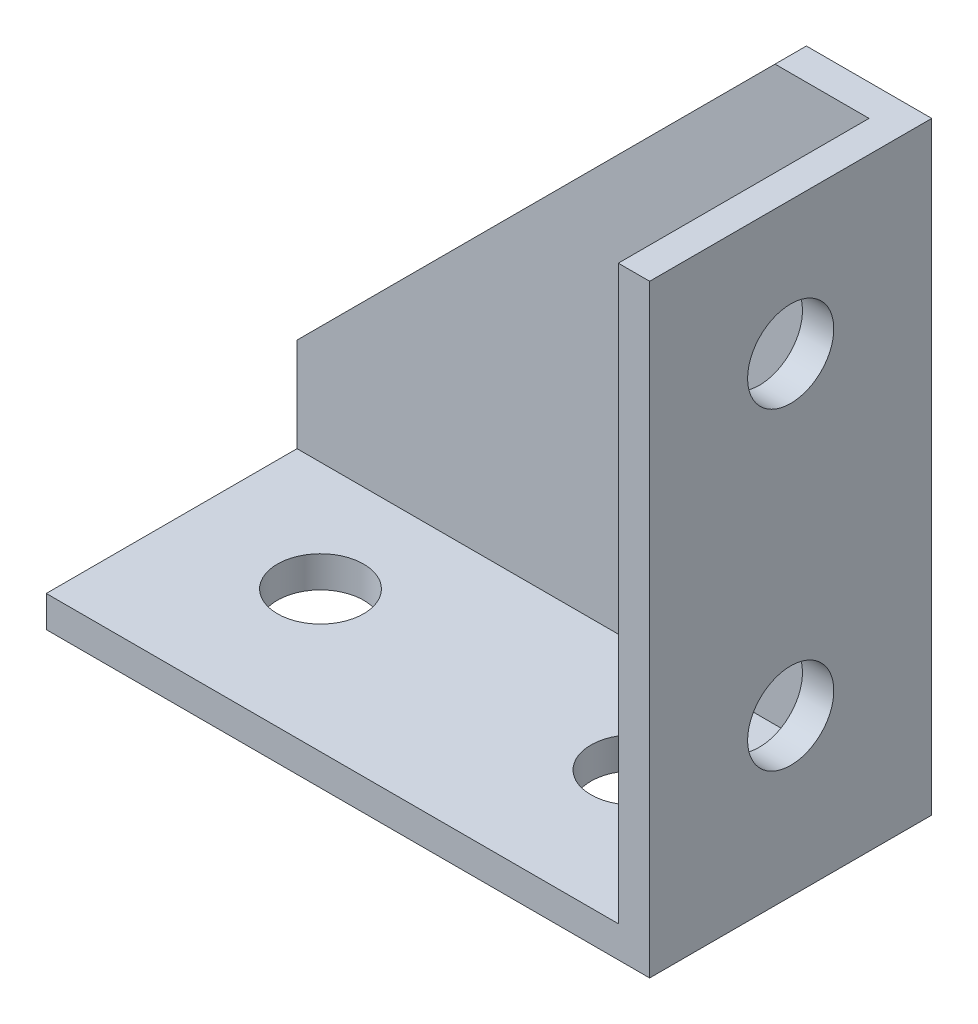
ISO-10303-21;
HEADER;
FILE_DESCRIPTION(('STEP AP214'),'2;1');
FILE_NAME('part.step','',(''),(''),'','','');
FILE_SCHEMA(('AUTOMOTIVE_DESIGN { 1 0 10303 214 1 1 1 1 }'));
ENDSEC;
DATA;
#1=APPLICATION_CONTEXT('core data for automotive mechanical design processes');
#2=APPLICATION_PROTOCOL_DEFINITION('international standard','automotive_design',2000,#1);
#3=PRODUCT_CONTEXT('',#1,'mechanical');
#4=PRODUCT('Part','Part','',(#3));
#5=PRODUCT_RELATED_PRODUCT_CATEGORY('part','',(#4));
#6=PRODUCT_DEFINITION_FORMATION('','',#4);
#7=PRODUCT_DEFINITION_CONTEXT('part definition',#1,'design');
#8=PRODUCT_DEFINITION('design','',#6,#7);
#9=PRODUCT_DEFINITION_SHAPE('','',#8);
#10=(LENGTH_UNIT() NAMED_UNIT(*) SI_UNIT(.MILLI.,.METRE.));
#11=(NAMED_UNIT(*) PLANE_ANGLE_UNIT() SI_UNIT($,.RADIAN.));
#12=(NAMED_UNIT(*) SI_UNIT($,.STERADIAN.) SOLID_ANGLE_UNIT());
#13=UNCERTAINTY_MEASURE_WITH_UNIT(LENGTH_MEASURE(1.E-05),#10,'distance_accuracy_value','');
#14=(GEOMETRIC_REPRESENTATION_CONTEXT(3) GLOBAL_UNCERTAINTY_ASSIGNED_CONTEXT((#13)) GLOBAL_UNIT_ASSIGNED_CONTEXT((#10,
#11,#12)) REPRESENTATION_CONTEXT('',''));
#15=CARTESIAN_POINT('',(0.,0.,0.));
#16=DIRECTION('',(0.,0.,1.));
#17=DIRECTION('',(1.,0.,0.));
#18=AXIS2_PLACEMENT_3D('',#15,#16,#17);
#19=CARTESIAN_POINT('',(0.,8.,18.));
#20=DIRECTION('',(0.707106781186547,-0.707106781186547,0.));
#21=DIRECTION('',(0.707106781186548,0.707106781186548,0.));
#22=AXIS2_PLACEMENT_3D('',#19,#20,#21);
#23=PLANE('',#22);
#24=DIRECTION('',(-0.707106781186547,-0.707106781186548,0.));
#25=VECTOR('',#24,1.);
#26=CARTESIAN_POINT('',(30.5,38.5,2.));
#27=LINE('',#26,#25);
#28=CARTESIAN_POINT('',(30.5,38.5,2.));
#29=VERTEX_POINT('',#28);
#30=CARTESIAN_POINT('',(0.,7.99999999999999,2.));
#31=VERTEX_POINT('',#30);
#32=EDGE_CURVE('E120',#29,#31,#27,.T.);
#33=ORIENTED_EDGE('',*,*,#32,.F.);
#34=DIRECTION('',(0.,0.,-1.));
#35=VECTOR('',#34,1.);
#36=CARTESIAN_POINT('',(30.5,38.5,18.));
#37=LINE('',#36,#35);
#38=CARTESIAN_POINT('',(30.5,38.5,0.));
#39=VERTEX_POINT('',#38);
#40=EDGE_CURVE('E155',#29,#39,#37,.T.);
#41=ORIENTED_EDGE('',*,*,#40,.T.);
#42=DIRECTION('',(-0.707106781186548,-0.707106781186548,0.));
#43=VECTOR('',#42,1.);
#44=CARTESIAN_POINT('',(0.,8.,0.));
#45=LINE('',#44,#43);
#46=CARTESIAN_POINT('',(0.,8.,0.));
#47=VERTEX_POINT('',#46);
#48=EDGE_CURVE('E148',#39,#47,#45,.T.);
#49=ORIENTED_EDGE('',*,*,#48,.T.);
#50=DIRECTION('',(0.,0.,-1.));
#51=VECTOR('',#50,1.);
#52=CARTESIAN_POINT('',(0.,8.,18.));
#53=LINE('',#52,#51);
#54=EDGE_CURVE('E153',#31,#47,#53,.T.);
#55=ORIENTED_EDGE('',*,*,#54,.F.);
#56=EDGE_LOOP('',(#33,#41,#49,#55));
#57=FACE_BOUND('',#56,.T.);
#58=ADVANCED_FACE('F35',(#57),#23,.F.);
#59=CARTESIAN_POINT('',(0.,0.,18.));
#60=DIRECTION('',(0.,1.,0.));
#61=DIRECTION('',(0.,0.,1.));
#62=AXIS2_PLACEMENT_3D('',#59,#60,#61);
#63=PLANE('',#62);
#64=CARTESIAN_POINT('',(8.5,0.,9.));
#65=DIRECTION('',(0.,1.,0.));
#66=DIRECTION('',(0.,0.,1.));
#67=AXIS2_PLACEMENT_3D('',#64,#65,#66);
#68=CIRCLE('',#67,2.74999999999999);
#69=CARTESIAN_POINT('',(8.5,0.,11.75));
#70=VERTEX_POINT('',#69);
#71=EDGE_CURVE('E247',#70,#70,#68,.T.);
#72=ORIENTED_EDGE('',*,*,#71,.T.);
#73=EDGE_LOOP('',(#72));
#74=FACE_BOUND('',#73,.T.);
#75=CARTESIAN_POINT('',(28.5,0.,9.));
#76=DIRECTION('',(0.,1.,0.));
#77=DIRECTION('',(0.,0.,1.));
#78=AXIS2_PLACEMENT_3D('',#75,#76,#77);
#79=CIRCLE('',#78,2.74999999999999);
#80=CARTESIAN_POINT('',(28.5,0.,11.75));
#81=VERTEX_POINT('',#80);
#82=EDGE_CURVE('E174',#81,#81,#79,.T.);
#83=ORIENTED_EDGE('',*,*,#82,.T.);
#84=EDGE_LOOP('',(#83));
#85=FACE_BOUND('',#84,.T.);
#86=DIRECTION('',(1.,0.,0.));
#87=VECTOR('',#86,1.);
#88=CARTESIAN_POINT('',(0.,0.,0.));
#89=LINE('',#88,#87);
#90=CARTESIAN_POINT('',(0.,0.,0.));
#91=VERTEX_POINT('',#90);
#92=CARTESIAN_POINT('',(38.5,0.,0.));
#93=VERTEX_POINT('',#92);
#94=EDGE_CURVE('E140',#91,#93,#89,.T.);
#95=ORIENTED_EDGE('',*,*,#94,.T.);
#96=DIRECTION('',(0.,0.,-1.));
#97=VECTOR('',#96,1.);
#98=CARTESIAN_POINT('',(38.5,0.,18.));
#99=LINE('',#98,#97);
#100=CARTESIAN_POINT('',(38.5,0.,18.));
#101=VERTEX_POINT('',#100);
#102=EDGE_CURVE('E11',#101,#93,#99,.T.);
#103=ORIENTED_EDGE('',*,*,#102,.F.);
#104=DIRECTION('',(1.,0.,0.));
#105=VECTOR('',#104,1.);
#106=CARTESIAN_POINT('',(0.,0.,18.));
#107=LINE('',#106,#105);
#108=CARTESIAN_POINT('',(0.,0.,18.));
#109=VERTEX_POINT('',#108);
#110=EDGE_CURVE('E132',#109,#101,#107,.T.);
#111=ORIENTED_EDGE('',*,*,#110,.F.);
#112=DIRECTION('',(0.,0.,-1.));
#113=VECTOR('',#112,1.);
#114=CARTESIAN_POINT('',(0.,0.,18.));
#115=LINE('',#114,#113);
#116=EDGE_CURVE('E139',#109,#91,#115,.T.);
#117=ORIENTED_EDGE('',*,*,#116,.T.);
#118=EDGE_LOOP('',(#95,#103,#111,#117));
#119=FACE_BOUND('',#118,.T.);
#120=ADVANCED_FACE('F37',(#74,#85,#119),#63,.F.);
#121=CARTESIAN_POINT('',(38.5,0.,18.));
#122=DIRECTION('',(-1.,0.,0.));
#123=DIRECTION('',(0.,0.,1.));
#124=AXIS2_PLACEMENT_3D('',#121,#122,#123);
#125=PLANE('',#124);
#126=CARTESIAN_POINT('',(38.5,10.,9.));
#127=DIRECTION('',(-1.,0.,0.));
#128=DIRECTION('',(0.,0.,1.));
#129=AXIS2_PLACEMENT_3D('',#126,#127,#128);
#130=CIRCLE('',#129,2.74999999999999);
#131=CARTESIAN_POINT('',(38.5,10.,11.75));
#132=VERTEX_POINT('',#131);
#133=EDGE_CURVE('E231',#132,#132,#130,.T.);
#134=ORIENTED_EDGE('',*,*,#133,.T.);
#135=EDGE_LOOP('',(#134));
#136=FACE_BOUND('',#135,.T.);
#137=CARTESIAN_POINT('',(38.5,30.,9.));
#138=DIRECTION('',(-1.,0.,0.));
#139=DIRECTION('',(0.,0.,1.));
#140=AXIS2_PLACEMENT_3D('',#137,#138,#139);
#141=CIRCLE('',#140,2.74999999999999);
#142=CARTESIAN_POINT('',(38.5,30.,11.75));
#143=VERTEX_POINT('',#142);
#144=EDGE_CURVE('E241',#143,#143,#141,.T.);
#145=ORIENTED_EDGE('',*,*,#144,.T.);
#146=EDGE_LOOP('',(#145));
#147=FACE_BOUND('',#146,.T.);
#148=DIRECTION('',(0.,1.,0.));
#149=VECTOR('',#148,1.);
#150=CARTESIAN_POINT('',(38.5,0.,0.));
#151=LINE('',#150,#149);
#152=CARTESIAN_POINT('',(38.5,38.5,0.));
#153=VERTEX_POINT('',#152);
#154=EDGE_CURVE('E143',#93,#153,#151,.T.);
#155=ORIENTED_EDGE('',*,*,#154,.T.);
#156=DIRECTION('',(0.,0.,-1.));
#157=VECTOR('',#156,1.);
#158=CARTESIAN_POINT('',(38.5,38.5,18.));
#159=LINE('',#158,#157);
#160=CARTESIAN_POINT('',(38.5,38.5,18.));
#161=VERTEX_POINT('',#160);
#162=EDGE_CURVE('E43',#161,#153,#159,.T.);
#163=ORIENTED_EDGE('',*,*,#162,.F.);
#164=DIRECTION('',(0.,1.,0.));
#165=VECTOR('',#164,1.);
#166=CARTESIAN_POINT('',(38.5,0.,18.));
#167=LINE('',#166,#165);
#168=EDGE_CURVE('E86',#101,#161,#167,.T.);
#169=ORIENTED_EDGE('',*,*,#168,.F.);
#170=ORIENTED_EDGE('',*,*,#102,.T.);
#171=EDGE_LOOP('',(#155,#163,#169,#170));
#172=FACE_BOUND('',#171,.T.);
#173=ADVANCED_FACE('F182',(#136,#147,#172),#125,.F.);
#174=CARTESIAN_POINT('',(30.5,38.5,18.));
#175=DIRECTION('',(0.,-1.,0.));
#176=DIRECTION('',(0.,0.,-1.));
#177=AXIS2_PLACEMENT_3D('',#174,#175,#176);
#178=PLANE('',#177);
#179=DIRECTION('',(-1.,0.,0.));
#180=VECTOR('',#179,1.);
#181=CARTESIAN_POINT('',(36.5,38.5,2.));
#182=LINE('',#181,#180);
#183=CARTESIAN_POINT('',(36.5,38.5,2.));
#184=VERTEX_POINT('',#183);
#185=EDGE_CURVE('E128',#184,#29,#182,.T.);
#186=ORIENTED_EDGE('',*,*,#185,.F.);
#187=DIRECTION('',(0.,0.,1.));
#188=VECTOR('',#187,1.);
#189=CARTESIAN_POINT('',(36.5,38.5,2.));
#190=LINE('',#189,#188);
#191=CARTESIAN_POINT('',(36.5,38.5,18.));
#192=VERTEX_POINT('',#191);
#193=EDGE_CURVE('E126',#184,#192,#190,.T.);
#194=ORIENTED_EDGE('',*,*,#193,.T.);
#195=DIRECTION('',(-1.,0.,0.));
#196=VECTOR('',#195,1.);
#197=CARTESIAN_POINT('',(30.5,38.5,18.));
#198=LINE('',#197,#196);
#199=EDGE_CURVE('E135',#161,#192,#198,.T.);
#200=ORIENTED_EDGE('',*,*,#199,.F.);
#201=ORIENTED_EDGE('',*,*,#162,.T.);
#202=DIRECTION('',(-1.,0.,0.));
#203=VECTOR('',#202,1.);
#204=CARTESIAN_POINT('',(30.5,38.5,0.));
#205=LINE('',#204,#203);
#206=EDGE_CURVE('E145',#153,#39,#205,.T.);
#207=ORIENTED_EDGE('',*,*,#206,.T.);
#208=ORIENTED_EDGE('',*,*,#40,.F.);
#209=EDGE_LOOP('',(#186,#194,#200,#201,#207,#208));
#210=FACE_BOUND('',#209,.T.);
#211=ADVANCED_FACE('F161',(#210),#178,.F.);
#212=CARTESIAN_POINT('',(0.,0.,18.));
#213=DIRECTION('',(1.,0.,0.));
#214=DIRECTION('',(0.,0.,-1.));
#215=AXIS2_PLACEMENT_3D('',#212,#213,#214);
#216=PLANE('',#215);
#217=DIRECTION('',(0.,-1.,0.));
#218=VECTOR('',#217,1.);
#219=CARTESIAN_POINT('',(0.,0.,18.));
#220=LINE('',#219,#218);
#221=CARTESIAN_POINT('',(0.,2.,18.));
#222=VERTEX_POINT('',#221);
#223=EDGE_CURVE('E58',#222,#109,#220,.T.);
#224=ORIENTED_EDGE('',*,*,#223,.F.);
#225=DIRECTION('',(0.,0.,1.));
#226=VECTOR('',#225,1.);
#227=CARTESIAN_POINT('',(0.,2.,2.));
#228=LINE('',#227,#226);
#229=CARTESIAN_POINT('',(0.,2.,2.));
#230=VERTEX_POINT('',#229);
#231=EDGE_CURVE('E50',#230,#222,#228,.T.);
#232=ORIENTED_EDGE('',*,*,#231,.F.);
#233=DIRECTION('',(0.,-1.,0.));
#234=VECTOR('',#233,1.);
#235=CARTESIAN_POINT('',(0.,7.99999999999999,2.));
#236=LINE('',#235,#234);
#237=EDGE_CURVE('E115',#31,#230,#236,.T.);
#238=ORIENTED_EDGE('',*,*,#237,.F.);
#239=ORIENTED_EDGE('',*,*,#54,.T.);
#240=DIRECTION('',(0.,-1.,0.));
#241=VECTOR('',#240,1.);
#242=CARTESIAN_POINT('',(0.,0.,0.));
#243=LINE('',#242,#241);
#244=EDGE_CURVE('E81',#47,#91,#243,.T.);
#245=ORIENTED_EDGE('',*,*,#244,.T.);
#246=ORIENTED_EDGE('',*,*,#116,.F.);
#247=EDGE_LOOP('',(#224,#232,#238,#239,#245,#246));
#248=FACE_BOUND('',#247,.T.);
#249=ADVANCED_FACE('F124',(#248),#216,.F.);
#250=CARTESIAN_POINT('',(0.,0.,18.));
#251=DIRECTION('',(0.,0.,1.));
#252=DIRECTION('',(1.,0.,0.));
#253=AXIS2_PLACEMENT_3D('',#250,#251,#252);
#254=PLANE('',#253);
#255=DIRECTION('',(0.,1.,0.));
#256=VECTOR('',#255,1.);
#257=CARTESIAN_POINT('',(36.5,2.,18.));
#258=LINE('',#257,#256);
#259=CARTESIAN_POINT('',(36.5,2.,18.));
#260=VERTEX_POINT('',#259);
#261=EDGE_CURVE('E122',#260,#192,#258,.T.);
#262=ORIENTED_EDGE('',*,*,#261,.F.);
#263=DIRECTION('',(1.,0.,0.));
#264=VECTOR('',#263,1.);
#265=CARTESIAN_POINT('',(0.,2.,18.));
#266=LINE('',#265,#264);
#267=EDGE_CURVE('E172',#222,#260,#266,.T.);
#268=ORIENTED_EDGE('',*,*,#267,.F.);
#269=ORIENTED_EDGE('',*,*,#223,.T.);
#270=ORIENTED_EDGE('',*,*,#110,.T.);
#271=ORIENTED_EDGE('',*,*,#168,.T.);
#272=ORIENTED_EDGE('',*,*,#199,.T.);
#273=EDGE_LOOP('',(#262,#268,#269,#270,#271,#272));
#274=FACE_BOUND('',#273,.T.);
#275=ADVANCED_FACE('F178',(#274),#254,.T.);
#276=CARTESIAN_POINT('',(0.,0.,0.));
#277=DIRECTION('',(0.,0.,1.));
#278=DIRECTION('',(1.,0.,0.));
#279=AXIS2_PLACEMENT_3D('',#276,#277,#278);
#280=PLANE('',#279);
#281=ORIENTED_EDGE('',*,*,#94,.F.);
#282=ORIENTED_EDGE('',*,*,#244,.F.);
#283=ORIENTED_EDGE('',*,*,#48,.F.);
#284=ORIENTED_EDGE('',*,*,#206,.F.);
#285=ORIENTED_EDGE('',*,*,#154,.F.);
#286=EDGE_LOOP('',(#281,#282,#283,#284,#285));
#287=FACE_BOUND('',#286,.T.);
#288=ADVANCED_FACE('F167',(#287),#280,.F.);
#289=CARTESIAN_POINT('',(36.5,2.,2.));
#290=DIRECTION('',(1.,0.,0.));
#291=DIRECTION('',(0.,0.,-1.));
#292=AXIS2_PLACEMENT_3D('',#289,#290,#291);
#293=PLANE('',#292);
#294=CARTESIAN_POINT('',(36.5,10.,9.));
#295=DIRECTION('',(-1.,0.,0.));
#296=DIRECTION('',(0.,0.,1.));
#297=AXIS2_PLACEMENT_3D('',#294,#295,#296);
#298=CIRCLE('',#297,2.74999999999999);
#299=CARTESIAN_POINT('',(36.5,10.,11.75));
#300=VERTEX_POINT('',#299);
#301=EDGE_CURVE('E234',#300,#300,#298,.T.);
#302=ORIENTED_EDGE('',*,*,#301,.F.);
#303=EDGE_LOOP('',(#302));
#304=FACE_BOUND('',#303,.T.);
#305=CARTESIAN_POINT('',(36.5,30.,9.));
#306=DIRECTION('',(-1.,0.,0.));
#307=DIRECTION('',(0.,0.,1.));
#308=AXIS2_PLACEMENT_3D('',#305,#306,#307);
#309=CIRCLE('',#308,2.74999999999999);
#310=CARTESIAN_POINT('',(36.5,30.,11.75));
#311=VERTEX_POINT('',#310);
#312=EDGE_CURVE('E236',#311,#311,#309,.T.);
#313=ORIENTED_EDGE('',*,*,#312,.F.);
#314=EDGE_LOOP('',(#313));
#315=FACE_BOUND('',#314,.T.);
#316=ORIENTED_EDGE('',*,*,#261,.T.);
#317=ORIENTED_EDGE('',*,*,#193,.F.);
#318=DIRECTION('',(0.,1.,0.));
#319=VECTOR('',#318,1.);
#320=CARTESIAN_POINT('',(36.5,2.,2.));
#321=LINE('',#320,#319);
#322=CARTESIAN_POINT('',(36.5,2.,2.));
#323=VERTEX_POINT('',#322);
#324=EDGE_CURVE('E114',#323,#184,#321,.T.);
#325=ORIENTED_EDGE('',*,*,#324,.F.);
#326=DIRECTION('',(0.,0.,1.));
#327=VECTOR('',#326,1.);
#328=CARTESIAN_POINT('',(36.5,2.,2.));
#329=LINE('',#328,#327);
#330=EDGE_CURVE('E110',#323,#260,#329,.T.);
#331=ORIENTED_EDGE('',*,*,#330,.T.);
#332=EDGE_LOOP('',(#316,#317,#325,#331));
#333=FACE_BOUND('',#332,.T.);
#334=ADVANCED_FACE('F177',(#304,#315,#333),#293,.F.);
#335=CARTESIAN_POINT('',(0.,2.,2.));
#336=DIRECTION('',(0.,-1.,0.));
#337=DIRECTION('',(0.,0.,-1.));
#338=AXIS2_PLACEMENT_3D('',#335,#336,#337);
#339=PLANE('',#338);
#340=CARTESIAN_POINT('',(8.5,2.,9.));
#341=DIRECTION('',(0.,1.,0.));
#342=DIRECTION('',(0.,0.,1.));
#343=AXIS2_PLACEMENT_3D('',#340,#341,#342);
#344=CIRCLE('',#343,2.74999999999999);
#345=CARTESIAN_POINT('',(8.5,2.,11.75));
#346=VERTEX_POINT('',#345);
#347=EDGE_CURVE('E244',#346,#346,#344,.T.);
#348=ORIENTED_EDGE('',*,*,#347,.F.);
#349=EDGE_LOOP('',(#348));
#350=FACE_BOUND('',#349,.T.);
#351=CARTESIAN_POINT('',(28.5,2.,9.));
#352=DIRECTION('',(0.,1.,0.));
#353=DIRECTION('',(0.,0.,1.));
#354=AXIS2_PLACEMENT_3D('',#351,#352,#353);
#355=CIRCLE('',#354,2.74999999999999);
#356=CARTESIAN_POINT('',(28.5,2.,11.75));
#357=VERTEX_POINT('',#356);
#358=EDGE_CURVE('E250',#357,#357,#355,.T.);
#359=ORIENTED_EDGE('',*,*,#358,.F.);
#360=EDGE_LOOP('',(#359));
#361=FACE_BOUND('',#360,.T.);
#362=ORIENTED_EDGE('',*,*,#267,.T.);
#363=ORIENTED_EDGE('',*,*,#330,.F.);
#364=DIRECTION('',(1.,0.,0.));
#365=VECTOR('',#364,1.);
#366=CARTESIAN_POINT('',(0.,2.,2.));
#367=LINE('',#366,#365);
#368=EDGE_CURVE('E107',#230,#323,#367,.T.);
#369=ORIENTED_EDGE('',*,*,#368,.F.);
#370=ORIENTED_EDGE('',*,*,#231,.T.);
#371=EDGE_LOOP('',(#362,#363,#369,#370));
#372=FACE_BOUND('',#371,.T.);
#373=ADVANCED_FACE('F109',(#350,#361,#372),#339,.F.);
#374=CARTESIAN_POINT('',(0.,0.,2.));
#375=DIRECTION('',(0.,0.,1.));
#376=DIRECTION('',(1.,0.,0.));
#377=AXIS2_PLACEMENT_3D('',#374,#375,#376);
#378=PLANE('',#377);
#379=ORIENTED_EDGE('',*,*,#237,.T.);
#380=ORIENTED_EDGE('',*,*,#368,.T.);
#381=ORIENTED_EDGE('',*,*,#324,.T.);
#382=ORIENTED_EDGE('',*,*,#185,.T.);
#383=ORIENTED_EDGE('',*,*,#32,.T.);
#384=EDGE_LOOP('',(#379,#380,#381,#382,#383));
#385=FACE_BOUND('',#384,.T.);
#386=ADVANCED_FACE('F118',(#385),#378,.T.);
#387=CARTESIAN_POINT('',(28.5,2.,9.));
#388=DIRECTION('',(0.,1.,0.));
#389=DIRECTION('',(0.,0.,1.));
#390=AXIS2_PLACEMENT_3D('',#387,#388,#389);
#391=CYLINDRICAL_SURFACE('',#390,2.74999999999999);
#392=ORIENTED_EDGE('',*,*,#82,.F.);
#393=EDGE_LOOP('',(#392));
#394=FACE_BOUND('',#393,.T.);
#395=ORIENTED_EDGE('',*,*,#358,.T.);
#396=EDGE_LOOP('',(#395));
#397=FACE_BOUND('',#396,.T.);
#398=ADVANCED_FACE('F212',(#394,#397),#391,.F.);
#399=CARTESIAN_POINT('',(8.5,2.,9.));
#400=DIRECTION('',(0.,1.,0.));
#401=DIRECTION('',(0.,0.,1.));
#402=AXIS2_PLACEMENT_3D('',#399,#400,#401);
#403=CYLINDRICAL_SURFACE('',#402,2.74999999999999);
#404=ORIENTED_EDGE('',*,*,#71,.F.);
#405=EDGE_LOOP('',(#404));
#406=FACE_BOUND('',#405,.T.);
#407=ORIENTED_EDGE('',*,*,#347,.T.);
#408=EDGE_LOOP('',(#407));
#409=FACE_BOUND('',#408,.T.);
#410=ADVANCED_FACE('F215',(#406,#409),#403,.F.);
#411=CARTESIAN_POINT('',(36.5,30.,9.));
#412=DIRECTION('',(-1.,0.,0.));
#413=DIRECTION('',(0.,0.,1.));
#414=AXIS2_PLACEMENT_3D('',#411,#412,#413);
#415=CYLINDRICAL_SURFACE('',#414,2.74999999999999);
#416=ORIENTED_EDGE('',*,*,#144,.F.);
#417=EDGE_LOOP('',(#416));
#418=FACE_BOUND('',#417,.T.);
#419=ORIENTED_EDGE('',*,*,#312,.T.);
#420=EDGE_LOOP('',(#419));
#421=FACE_BOUND('',#420,.T.);
#422=ADVANCED_FACE('F219',(#418,#421),#415,.F.);
#423=CARTESIAN_POINT('',(36.5,10.,9.));
#424=DIRECTION('',(-1.,0.,0.));
#425=DIRECTION('',(0.,0.,1.));
#426=AXIS2_PLACEMENT_3D('',#423,#424,#425);
#427=CYLINDRICAL_SURFACE('',#426,2.74999999999999);
#428=ORIENTED_EDGE('',*,*,#133,.F.);
#429=EDGE_LOOP('',(#428));
#430=FACE_BOUND('',#429,.T.);
#431=ORIENTED_EDGE('',*,*,#301,.T.);
#432=EDGE_LOOP('',(#431));
#433=FACE_BOUND('',#432,.T.);
#434=ADVANCED_FACE('F223',(#430,#433),#427,.F.);
#435=CLOSED_SHELL('',(#58,#120,#173,#211,#249,#275,#288,#334,#373,#386,#398,#410,#422,#434));
#436=MANIFOLD_SOLID_BREP('B2',#435);
#437=ADVANCED_BREP_SHAPE_REPRESENTATION('',(#18,#436),#14);
#438=SHAPE_DEFINITION_REPRESENTATION(#9,#437);
ENDSEC;
END-ISO-10303-21;
